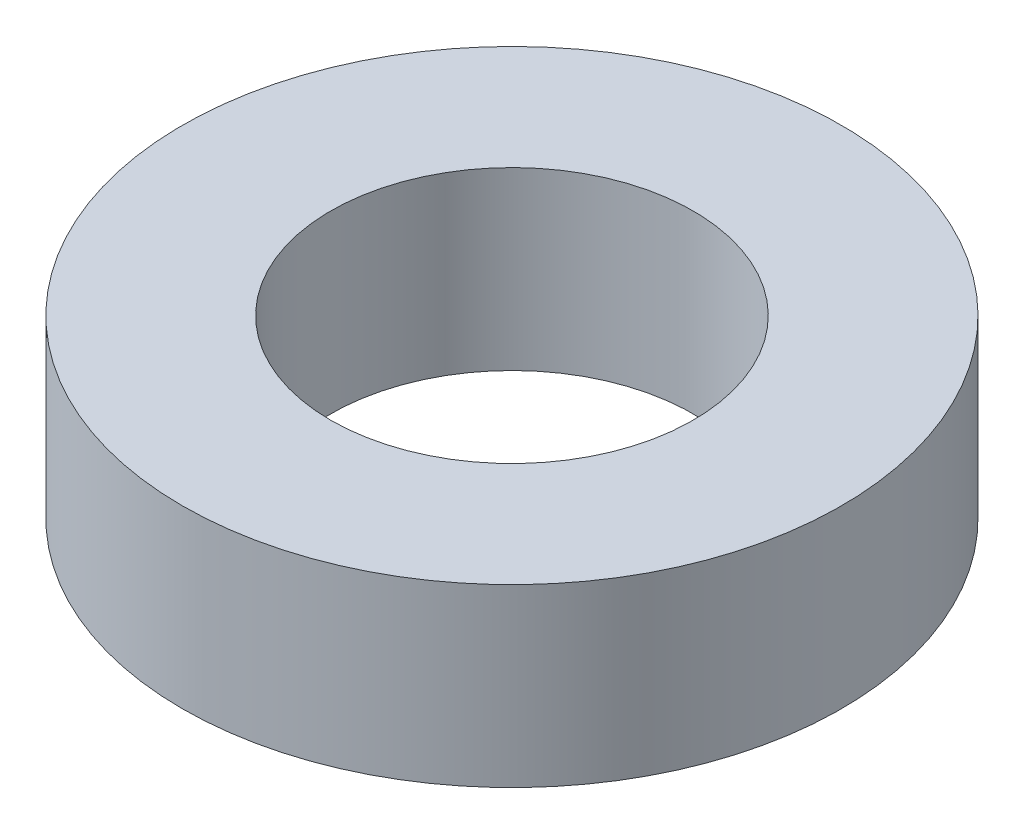
ISO-10303-21;
HEADER;
FILE_DESCRIPTION(('STEP AP214'),'2;1');
FILE_NAME('part.step','',(''),(''),'','','');
FILE_SCHEMA(('AUTOMOTIVE_DESIGN { 1 0 10303 214 1 1 1 1 }'));
ENDSEC;
DATA;
#1=APPLICATION_CONTEXT('core data for automotive mechanical design processes');
#2=APPLICATION_PROTOCOL_DEFINITION('international standard','automotive_design',2000,#1);
#3=PRODUCT_CONTEXT('',#1,'mechanical');
#4=PRODUCT('Part','Part','',(#3));
#5=PRODUCT_RELATED_PRODUCT_CATEGORY('part','',(#4));
#6=PRODUCT_DEFINITION_FORMATION('','',#4);
#7=PRODUCT_DEFINITION_CONTEXT('part definition',#1,'design');
#8=PRODUCT_DEFINITION('design','',#6,#7);
#9=PRODUCT_DEFINITION_SHAPE('','',#8);
#10=(LENGTH_UNIT() NAMED_UNIT(*) SI_UNIT(.MILLI.,.METRE.));
#11=(NAMED_UNIT(*) PLANE_ANGLE_UNIT() SI_UNIT($,.RADIAN.));
#12=(NAMED_UNIT(*) SI_UNIT($,.STERADIAN.) SOLID_ANGLE_UNIT());
#13=UNCERTAINTY_MEASURE_WITH_UNIT(LENGTH_MEASURE(1.E-05),#10,'distance_accuracy_value','');
#14=(GEOMETRIC_REPRESENTATION_CONTEXT(3) GLOBAL_UNCERTAINTY_ASSIGNED_CONTEXT((#13)) GLOBAL_UNIT_ASSIGNED_CONTEXT((#10,
#11,#12)) REPRESENTATION_CONTEXT('',''));
#15=CARTESIAN_POINT('',(0.,0.,0.));
#16=DIRECTION('',(0.,0.,1.));
#17=DIRECTION('',(1.,0.,0.));
#18=AXIS2_PLACEMENT_3D('',#15,#16,#17);
#19=CARTESIAN_POINT('',(0.,1.6,0.));
#20=DIRECTION('',(0.,1.,0.));
#21=DIRECTION('',(0.,0.,1.));
#22=AXIS2_PLACEMENT_3D('',#19,#20,#21);
#23=PLANE('',#22);
#24=CARTESIAN_POINT('',(0.,1.6,0.));
#25=DIRECTION('',(0.,1.,0.));
#26=DIRECTION('',(0.,0.,1.));
#27=AXIS2_PLACEMENT_3D('',#24,#25,#26);
#28=CIRCLE('',#27,3.);
#29=CARTESIAN_POINT('',(0.,1.6,3.));
#30=VERTEX_POINT('',#29);
#31=EDGE_CURVE('E10',#30,#30,#28,.T.);
#32=ORIENTED_EDGE('',*,*,#31,.T.);
#33=EDGE_LOOP('',(#32));
#34=FACE_BOUND('',#33,.T.);
#35=CARTESIAN_POINT('',(0.,1.6,0.));
#36=DIRECTION('',(0.,1.,0.));
#37=DIRECTION('',(0.,0.,1.));
#38=AXIS2_PLACEMENT_3D('',#35,#36,#37);
#39=CIRCLE('',#38,1.65);
#40=CARTESIAN_POINT('',(0.,1.6,1.65));
#41=VERTEX_POINT('',#40);
#42=EDGE_CURVE('E48',#41,#41,#39,.T.);
#43=ORIENTED_EDGE('',*,*,#42,.F.);
#44=EDGE_LOOP('',(#43));
#45=FACE_BOUND('',#44,.T.);
#46=ADVANCED_FACE('F37',(#34,#45),#23,.T.);
#47=CARTESIAN_POINT('',(0.,0.,0.));
#48=DIRECTION('',(0.,1.,0.));
#49=DIRECTION('',(0.,0.,1.));
#50=AXIS2_PLACEMENT_3D('',#47,#48,#49);
#51=PLANE('',#50);
#52=CARTESIAN_POINT('',(0.,0.,0.));
#53=DIRECTION('',(0.,1.,0.));
#54=DIRECTION('',(0.,0.,1.));
#55=AXIS2_PLACEMENT_3D('',#52,#53,#54);
#56=CIRCLE('',#55,3.);
#57=CARTESIAN_POINT('',(0.,0.,3.));
#58=VERTEX_POINT('',#57);
#59=EDGE_CURVE('E41',#58,#58,#56,.T.);
#60=ORIENTED_EDGE('',*,*,#59,.F.);
#61=EDGE_LOOP('',(#60));
#62=FACE_BOUND('',#61,.T.);
#63=CARTESIAN_POINT('',(0.,0.,0.));
#64=DIRECTION('',(0.,1.,0.));
#65=DIRECTION('',(0.,0.,1.));
#66=AXIS2_PLACEMENT_3D('',#63,#64,#65);
#67=CIRCLE('',#66,1.65);
#68=CARTESIAN_POINT('',(0.,0.,1.65));
#69=VERTEX_POINT('',#68);
#70=EDGE_CURVE('E50',#69,#69,#67,.T.);
#71=ORIENTED_EDGE('',*,*,#70,.T.);
#72=EDGE_LOOP('',(#71));
#73=FACE_BOUND('',#72,.T.);
#74=ADVANCED_FACE('F60',(#62,#73),#51,.F.);
#75=CARTESIAN_POINT('',(0.,1.6,0.));
#76=DIRECTION('',(0.,-1.,0.));
#77=DIRECTION('',(0.,0.,-1.));
#78=AXIS2_PLACEMENT_3D('',#75,#76,#77);
#79=CYLINDRICAL_SURFACE('',#78,3.);
#80=ORIENTED_EDGE('',*,*,#31,.F.);
#81=EDGE_LOOP('',(#80));
#82=FACE_BOUND('',#81,.T.);
#83=ORIENTED_EDGE('',*,*,#59,.T.);
#84=EDGE_LOOP('',(#83));
#85=FACE_BOUND('',#84,.T.);
#86=ADVANCED_FACE('F39',(#82,#85),#79,.T.);
#87=CARTESIAN_POINT('',(0.,1.6,0.));
#88=DIRECTION('',(0.,-1.,0.));
#89=DIRECTION('',(0.,0.,-1.));
#90=AXIS2_PLACEMENT_3D('',#87,#88,#89);
#91=CYLINDRICAL_SURFACE('',#90,1.65);
#92=ORIENTED_EDGE('',*,*,#42,.T.);
#93=EDGE_LOOP('',(#92));
#94=FACE_BOUND('',#93,.T.);
#95=ORIENTED_EDGE('',*,*,#70,.F.);
#96=EDGE_LOOP('',(#95));
#97=FACE_BOUND('',#96,.T.);
#98=ADVANCED_FACE('F56',(#94,#97),#91,.F.);
#99=CLOSED_SHELL('',(#46,#74,#86,#98));
#100=MANIFOLD_SOLID_BREP('B2',#99);
#101=ADVANCED_BREP_SHAPE_REPRESENTATION('',(#18,#100),#14);
#102=SHAPE_DEFINITION_REPRESENTATION(#9,#101);
ENDSEC;
END-ISO-10303-21;
